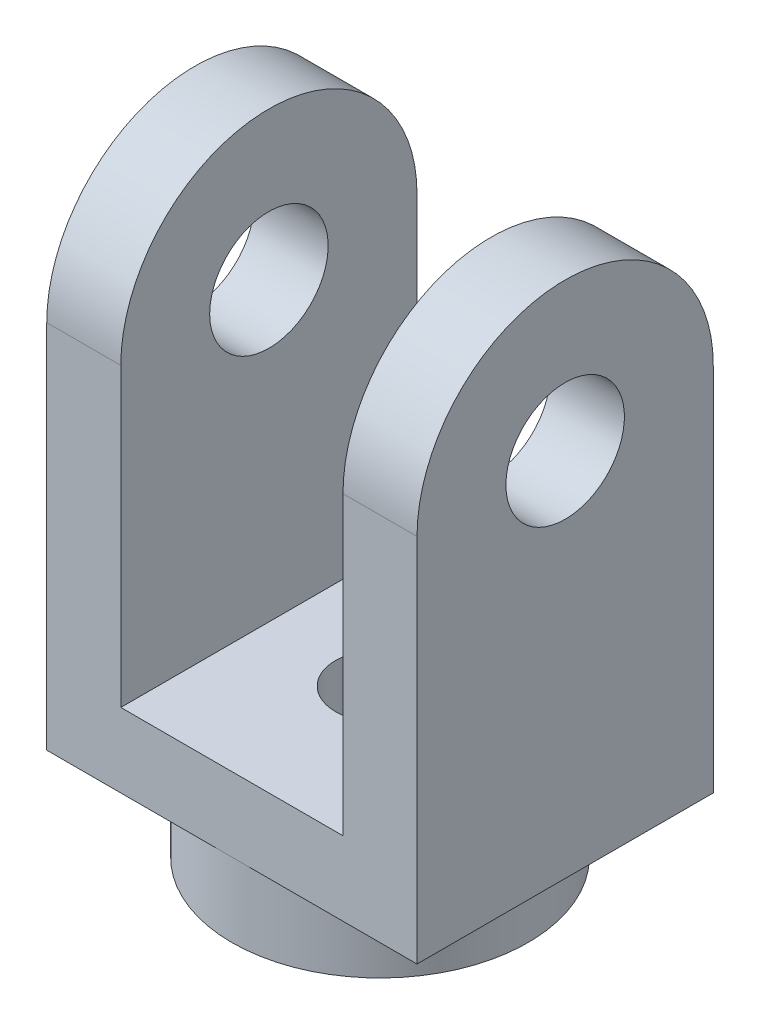
ISO-10303-21;
HEADER;
FILE_DESCRIPTION(('STEP AP214'),'2;1');
FILE_NAME('part.step','',(''),(''),'','','');
FILE_SCHEMA(('AUTOMOTIVE_DESIGN { 1 0 10303 214 1 1 1 1 }'));
ENDSEC;
DATA;
#1=APPLICATION_CONTEXT('core data for automotive mechanical design processes');
#2=APPLICATION_PROTOCOL_DEFINITION('international standard','automotive_design',2000,#1);
#3=PRODUCT_CONTEXT('',#1,'mechanical');
#4=PRODUCT('Part','Part','',(#3));
#5=PRODUCT_RELATED_PRODUCT_CATEGORY('part','',(#4));
#6=PRODUCT_DEFINITION_FORMATION('','',#4);
#7=PRODUCT_DEFINITION_CONTEXT('part definition',#1,'design');
#8=PRODUCT_DEFINITION('design','',#6,#7);
#9=PRODUCT_DEFINITION_SHAPE('','',#8);
#10=(LENGTH_UNIT() NAMED_UNIT(*) SI_UNIT(.MILLI.,.METRE.));
#11=(NAMED_UNIT(*) PLANE_ANGLE_UNIT() SI_UNIT($,.RADIAN.));
#12=(NAMED_UNIT(*) SI_UNIT($,.STERADIAN.) SOLID_ANGLE_UNIT());
#13=UNCERTAINTY_MEASURE_WITH_UNIT(LENGTH_MEASURE(1.E-05),#10,'distance_accuracy_value','');
#14=(GEOMETRIC_REPRESENTATION_CONTEXT(3) GLOBAL_UNCERTAINTY_ASSIGNED_CONTEXT((#13)) GLOBAL_UNIT_ASSIGNED_CONTEXT((#10,
#11,#12)) REPRESENTATION_CONTEXT('',''));
#15=CARTESIAN_POINT('',(0.,0.,0.));
#16=DIRECTION('',(0.,0.,1.));
#17=DIRECTION('',(1.,0.,0.));
#18=AXIS2_PLACEMENT_3D('',#15,#16,#17);
#19=CARTESIAN_POINT('',(0.,50.,0.));
#20=DIRECTION('',(0.,-1.,0.));
#21=DIRECTION('',(0.,0.,-1.));
#22=AXIS2_PLACEMENT_3D('',#19,#20,#21);
#23=PLANE('',#22);
#24=CARTESIAN_POINT('',(0.,50.,0.));
#25=DIRECTION('',(0.,-1.,0.));
#26=DIRECTION('',(0.,0.,-1.));
#27=AXIS2_PLACEMENT_3D('',#24,#25,#26);
#28=CIRCLE('',#27,15.);
#29=CARTESIAN_POINT('',(0.,50.,-15.));
#30=VERTEX_POINT('',#29);
#31=EDGE_CURVE('E181',#30,#30,#28,.T.);
#32=ORIENTED_EDGE('',*,*,#31,.T.);
#33=EDGE_LOOP('',(#32));
#34=FACE_BOUND('',#33,.T.);
#35=DIRECTION('',(0.,0.,1.));
#36=VECTOR('',#35,1.);
#37=CARTESIAN_POINT('',(37.5,50.,-50.));
#38=LINE('',#37,#36);
#39=CARTESIAN_POINT('',(37.5,50.,-50.));
#40=VERTEX_POINT('',#39);
#41=CARTESIAN_POINT('',(37.5,50.,50.));
#42=VERTEX_POINT('',#41);
#43=EDGE_CURVE('E185',#40,#42,#38,.T.);
#44=ORIENTED_EDGE('',*,*,#43,.F.);
#45=DIRECTION('',(1.,0.,0.));
#46=VECTOR('',#45,1.);
#47=CARTESIAN_POINT('',(-62.5,50.,-50.));
#48=LINE('',#47,#46);
#49=CARTESIAN_POINT('',(-37.5,50.,-50.));
#50=VERTEX_POINT('',#49);
#51=EDGE_CURVE('E153',#50,#40,#48,.T.);
#52=ORIENTED_EDGE('',*,*,#51,.F.);
#53=DIRECTION('',(0.,0.,-1.));
#54=VECTOR('',#53,1.);
#55=CARTESIAN_POINT('',(-37.5,50.,-50.));
#56=LINE('',#55,#54);
#57=CARTESIAN_POINT('',(-37.5,50.,50.));
#58=VERTEX_POINT('',#57);
#59=EDGE_CURVE('E75',#58,#50,#56,.T.);
#60=ORIENTED_EDGE('',*,*,#59,.F.);
#61=DIRECTION('',(1.,0.,0.));
#62=VECTOR('',#61,1.);
#63=CARTESIAN_POINT('',(-62.5,50.,50.));
#64=LINE('',#63,#62);
#65=EDGE_CURVE('E214',#58,#42,#64,.T.);
#66=ORIENTED_EDGE('',*,*,#65,.T.);
#67=EDGE_LOOP('',(#44,#52,#60,#66));
#68=FACE_BOUND('',#67,.T.);
#69=ADVANCED_FACE('F57',(#34,#68),#23,.F.);
#70=CARTESIAN_POINT('',(0.,0.,0.));
#71=DIRECTION('',(0.,1.,0.));
#72=DIRECTION('',(0.,0.,1.));
#73=AXIS2_PLACEMENT_3D('',#70,#71,#72);
#74=PLANE('',#73);
#75=CARTESIAN_POINT('',(0.,0.,0.));
#76=DIRECTION('',(0.,1.,0.));
#77=DIRECTION('',(0.,0.,1.));
#78=AXIS2_PLACEMENT_3D('',#75,#76,#77);
#79=CIRCLE('',#78,15.);
#80=CARTESIAN_POINT('',(0.,0.,15.));
#81=VERTEX_POINT('',#80);
#82=EDGE_CURVE('E174',#81,#81,#79,.T.);
#83=ORIENTED_EDGE('',*,*,#82,.T.);
#84=EDGE_LOOP('',(#83));
#85=FACE_BOUND('',#84,.T.);
#86=CARTESIAN_POINT('',(0.,0.,0.));
#87=DIRECTION('',(0.,1.,0.));
#88=DIRECTION('',(0.,0.,1.));
#89=AXIS2_PLACEMENT_3D('',#86,#87,#88);
#90=CIRCLE('',#89,50.);
#91=CARTESIAN_POINT('',(0.,0.,50.));
#92=VERTEX_POINT('',#91);
#93=EDGE_CURVE('E243',#92,#92,#90,.T.);
#94=ORIENTED_EDGE('',*,*,#93,.F.);
#95=EDGE_LOOP('',(#94));
#96=FACE_BOUND('',#95,.T.);
#97=ADVANCED_FACE('F288',(#85,#96),#74,.F.);
#98=CARTESIAN_POINT('',(0.,25.,0.));
#99=DIRECTION('',(0.,-1.,0.));
#100=DIRECTION('',(0.,0.,-1.));
#101=AXIS2_PLACEMENT_3D('',#98,#99,#100);
#102=CYLINDRICAL_SURFACE('',#101,50.);
#103=CARTESIAN_POINT('',(0.,25.,0.));
#104=DIRECTION('',(0.,1.,0.));
#105=DIRECTION('',(0.,0.,1.));
#106=AXIS2_PLACEMENT_3D('',#103,#104,#105);
#107=CIRCLE('',#106,50.);
#108=CARTESIAN_POINT('',(0.,25.,50.));
#109=VERTEX_POINT('',#108);
#110=CARTESIAN_POINT('',(0.,25.,-50.));
#111=VERTEX_POINT('',#110);
#112=EDGE_CURVE('E14',#109,#111,#107,.T.);
#113=ORIENTED_EDGE('',*,*,#112,.F.);
#114=EDGE_CURVE('E67',#111,#109,#107,.T.);
#115=ORIENTED_EDGE('',*,*,#114,.F.);
#116=EDGE_LOOP('',(#113,#115));
#117=FACE_BOUND('',#116,.T.);
#118=ORIENTED_EDGE('',*,*,#93,.T.);
#119=EDGE_LOOP('',(#118));
#120=FACE_BOUND('',#119,.T.);
#121=ADVANCED_FACE('F59',(#117,#120),#102,.T.);
#122=CARTESIAN_POINT('',(0.,25.,0.));
#123=DIRECTION('',(0.,-1.,0.));
#124=DIRECTION('',(0.,0.,-1.));
#125=AXIS2_PLACEMENT_3D('',#122,#123,#124);
#126=PLANE('',#125);
#127=DIRECTION('',(1.,0.,0.));
#128=VECTOR('',#127,1.);
#129=CARTESIAN_POINT('',(-62.5,25.,-50.));
#130=LINE('',#129,#128);
#131=CARTESIAN_POINT('',(62.5,25.,-50.));
#132=VERTEX_POINT('',#131);
#133=EDGE_CURVE('E227',#111,#132,#130,.T.);
#134=ORIENTED_EDGE('',*,*,#133,.T.);
#135=DIRECTION('',(0.,0.,1.));
#136=VECTOR('',#135,1.);
#137=CARTESIAN_POINT('',(62.5,25.,-50.));
#138=LINE('',#137,#136);
#139=CARTESIAN_POINT('',(62.5,25.,50.));
#140=VERTEX_POINT('',#139);
#141=EDGE_CURVE('E223',#132,#140,#138,.T.);
#142=ORIENTED_EDGE('',*,*,#141,.T.);
#143=DIRECTION('',(1.,0.,0.));
#144=VECTOR('',#143,1.);
#145=CARTESIAN_POINT('',(-62.5,25.,50.));
#146=LINE('',#145,#144);
#147=EDGE_CURVE('E213',#109,#140,#146,.T.);
#148=ORIENTED_EDGE('',*,*,#147,.F.);
#149=ORIENTED_EDGE('',*,*,#112,.T.);
#150=EDGE_LOOP('',(#134,#142,#148,#149));
#151=FACE_BOUND('',#150,.T.);
#152=ADVANCED_FACE('F255',(#151),#126,.T.);
#153=CARTESIAN_POINT('',(-62.5,50.,50.));
#154=DIRECTION('',(0.,0.,-1.));
#155=DIRECTION('',(-1.,0.,0.));
#156=AXIS2_PLACEMENT_3D('',#153,#154,#155);
#157=PLANE('',#156);
#158=ORIENTED_EDGE('',*,*,#147,.T.);
#159=DIRECTION('',(0.,-1.,0.));
#160=VECTOR('',#159,1.);
#161=CARTESIAN_POINT('',(62.5,50.,50.));
#162=LINE('',#161,#160);
#163=CARTESIAN_POINT('',(62.5,150.,50.));
#164=VERTEX_POINT('',#163);
#165=EDGE_CURVE('E240',#164,#140,#162,.T.);
#166=ORIENTED_EDGE('',*,*,#165,.F.);
#167=DIRECTION('',(1.,0.,0.));
#168=VECTOR('',#167,1.);
#169=CARTESIAN_POINT('',(62.5,150.,50.));
#170=LINE('',#169,#168);
#171=CARTESIAN_POINT('',(37.5,150.,50.));
#172=VERTEX_POINT('',#171);
#173=EDGE_CURVE('E190',#172,#164,#170,.T.);
#174=ORIENTED_EDGE('',*,*,#173,.F.);
#175=DIRECTION('',(0.,-1.,0.));
#176=VECTOR('',#175,1.);
#177=CARTESIAN_POINT('',(37.5,150.,50.));
#178=LINE('',#177,#176);
#179=EDGE_CURVE('E194',#172,#42,#178,.T.);
#180=ORIENTED_EDGE('',*,*,#179,.T.);
#181=ORIENTED_EDGE('',*,*,#65,.F.);
#182=DIRECTION('',(0.,-1.,0.));
#183=VECTOR('',#182,1.);
#184=CARTESIAN_POINT('',(-37.5,150.,50.));
#185=LINE('',#184,#183);
#186=CARTESIAN_POINT('',(-37.5,150.,50.));
#187=VERTEX_POINT('',#186);
#188=EDGE_CURVE('E137',#187,#58,#185,.T.);
#189=ORIENTED_EDGE('',*,*,#188,.F.);
#190=DIRECTION('',(1.,0.,0.));
#191=VECTOR('',#190,1.);
#192=CARTESIAN_POINT('',(-62.5,150.,50.));
#193=LINE('',#192,#191);
#194=CARTESIAN_POINT('',(-62.5,150.,50.));
#195=VERTEX_POINT('',#194);
#196=EDGE_CURVE('E130',#195,#187,#193,.T.);
#197=ORIENTED_EDGE('',*,*,#196,.F.);
#198=DIRECTION('',(0.,-1.,0.));
#199=VECTOR('',#198,1.);
#200=CARTESIAN_POINT('',(-62.5,50.,50.));
#201=LINE('',#200,#199);
#202=CARTESIAN_POINT('',(-62.5,25.,50.));
#203=VERTEX_POINT('',#202);
#204=EDGE_CURVE('E134',#195,#203,#201,.T.);
#205=ORIENTED_EDGE('',*,*,#204,.T.);
#206=EDGE_CURVE('E220',#203,#109,#146,.T.);
#207=ORIENTED_EDGE('',*,*,#206,.T.);
#208=EDGE_LOOP('',(#158,#166,#174,#180,#181,#189,#197,#205,#207));
#209=FACE_BOUND('',#208,.T.);
#210=ADVANCED_FACE('F132',(#209),#157,.F.);
#211=CARTESIAN_POINT('',(62.5,50.,-50.));
#212=DIRECTION('',(1.,0.,0.));
#213=DIRECTION('',(0.,0.,-1.));
#214=AXIS2_PLACEMENT_3D('',#211,#212,#213);
#215=PLANE('',#214);
#216=CARTESIAN_POINT('',(62.5,150.,0.));
#217=DIRECTION('',(-1.,0.,0.));
#218=DIRECTION('',(0.,0.,1.));
#219=AXIS2_PLACEMENT_3D('',#216,#217,#218);
#220=CIRCLE('',#219,20.);
#221=CARTESIAN_POINT('',(62.5,150.,20.));
#222=VERTEX_POINT('',#221);
#223=EDGE_CURVE('E448',#222,#222,#220,.T.);
#224=ORIENTED_EDGE('',*,*,#223,.T.);
#225=EDGE_LOOP('',(#224));
#226=FACE_BOUND('',#225,.T.);
#227=ORIENTED_EDGE('',*,*,#141,.F.);
#228=DIRECTION('',(0.,-1.,0.));
#229=VECTOR('',#228,1.);
#230=CARTESIAN_POINT('',(62.5,50.,-50.));
#231=LINE('',#230,#229);
#232=CARTESIAN_POINT('',(62.5,150.,-50.));
#233=VERTEX_POINT('',#232);
#234=EDGE_CURVE('E236',#233,#132,#231,.T.);
#235=ORIENTED_EDGE('',*,*,#234,.F.);
#236=CARTESIAN_POINT('',(62.5,150.,0.));
#237=DIRECTION('',(1.,0.,0.));
#238=DIRECTION('',(0.,0.,1.));
#239=AXIS2_PLACEMENT_3D('',#236,#237,#238);
#240=CIRCLE('',#239,50.);
#241=EDGE_CURVE('E164',#233,#164,#240,.T.);
#242=ORIENTED_EDGE('',*,*,#241,.T.);
#243=ORIENTED_EDGE('',*,*,#165,.T.);
#244=EDGE_LOOP('',(#227,#235,#242,#243));
#245=FACE_BOUND('',#244,.T.);
#246=ADVANCED_FACE('F264',(#226,#245),#215,.T.);
#247=CARTESIAN_POINT('',(-62.5,50.,-50.));
#248=DIRECTION('',(0.,0.,-1.));
#249=DIRECTION('',(-1.,0.,0.));
#250=AXIS2_PLACEMENT_3D('',#247,#248,#249);
#251=PLANE('',#250);
#252=ORIENTED_EDGE('',*,*,#51,.T.);
#253=DIRECTION('',(0.,-1.,0.));
#254=VECTOR('',#253,1.);
#255=CARTESIAN_POINT('',(37.5,150.,-50.));
#256=LINE('',#255,#254);
#257=CARTESIAN_POINT('',(37.5,150.,-50.));
#258=VERTEX_POINT('',#257);
#259=EDGE_CURVE('E200',#258,#40,#256,.T.);
#260=ORIENTED_EDGE('',*,*,#259,.F.);
#261=DIRECTION('',(-1.,0.,0.));
#262=VECTOR('',#261,1.);
#263=CARTESIAN_POINT('',(62.5,150.,-50.));
#264=LINE('',#263,#262);
#265=EDGE_CURVE('E186',#233,#258,#264,.T.);
#266=ORIENTED_EDGE('',*,*,#265,.F.);
#267=ORIENTED_EDGE('',*,*,#234,.T.);
#268=ORIENTED_EDGE('',*,*,#133,.F.);
#269=CARTESIAN_POINT('',(-62.5,25.,-50.));
#270=VERTEX_POINT('',#269);
#271=EDGE_CURVE('E228',#270,#111,#130,.T.);
#272=ORIENTED_EDGE('',*,*,#271,.F.);
#273=DIRECTION('',(0.,-1.,0.));
#274=VECTOR('',#273,1.);
#275=CARTESIAN_POINT('',(-62.5,50.,-50.));
#276=LINE('',#275,#274);
#277=CARTESIAN_POINT('',(-62.5,150.,-50.));
#278=VERTEX_POINT('',#277);
#279=EDGE_CURVE('E152',#278,#270,#276,.T.);
#280=ORIENTED_EDGE('',*,*,#279,.F.);
#281=DIRECTION('',(-1.,0.,0.));
#282=VECTOR('',#281,1.);
#283=CARTESIAN_POINT('',(-62.5,150.,-50.));
#284=LINE('',#283,#282);
#285=CARTESIAN_POINT('',(-37.5,150.,-50.));
#286=VERTEX_POINT('',#285);
#287=EDGE_CURVE('E143',#286,#278,#284,.T.);
#288=ORIENTED_EDGE('',*,*,#287,.F.);
#289=DIRECTION('',(0.,-1.,0.));
#290=VECTOR('',#289,1.);
#291=CARTESIAN_POINT('',(-37.5,150.,-50.));
#292=LINE('',#291,#290);
#293=EDGE_CURVE('E205',#286,#50,#292,.T.);
#294=ORIENTED_EDGE('',*,*,#293,.T.);
#295=EDGE_LOOP('',(#252,#260,#266,#267,#268,#272,#280,#288,#294));
#296=FACE_BOUND('',#295,.T.);
#297=ADVANCED_FACE('F261',(#296),#251,.T.);
#298=CARTESIAN_POINT('',(-62.5,50.,-50.));
#299=DIRECTION('',(1.,0.,0.));
#300=DIRECTION('',(0.,0.,-1.));
#301=AXIS2_PLACEMENT_3D('',#298,#299,#300);
#302=PLANE('',#301);
#303=CARTESIAN_POINT('',(-62.5,150.,0.));
#304=DIRECTION('',(1.,0.,0.));
#305=DIRECTION('',(0.,0.,-1.));
#306=AXIS2_PLACEMENT_3D('',#303,#304,#305);
#307=CIRCLE('',#306,20.);
#308=CARTESIAN_POINT('',(-62.5,150.,-20.));
#309=VERTEX_POINT('',#308);
#310=EDGE_CURVE('E160',#309,#309,#307,.T.);
#311=ORIENTED_EDGE('',*,*,#310,.T.);
#312=EDGE_LOOP('',(#311));
#313=FACE_BOUND('',#312,.T.);
#314=DIRECTION('',(0.,0.,1.));
#315=VECTOR('',#314,1.);
#316=CARTESIAN_POINT('',(-62.5,25.,-50.));
#317=LINE('',#316,#315);
#318=EDGE_CURVE('E150',#270,#203,#317,.T.);
#319=ORIENTED_EDGE('',*,*,#318,.T.);
#320=ORIENTED_EDGE('',*,*,#204,.F.);
#321=CARTESIAN_POINT('',(-62.5,150.,0.));
#322=DIRECTION('',(-1.,0.,0.));
#323=DIRECTION('',(0.,0.,-1.));
#324=AXIS2_PLACEMENT_3D('',#321,#322,#323);
#325=CIRCLE('',#324,50.);
#326=EDGE_CURVE('E148',#195,#278,#325,.T.);
#327=ORIENTED_EDGE('',*,*,#326,.T.);
#328=ORIENTED_EDGE('',*,*,#279,.T.);
#329=EDGE_LOOP('',(#319,#320,#327,#328));
#330=FACE_BOUND('',#329,.T.);
#331=ADVANCED_FACE('F147',(#313,#330),#302,.F.);
#332=ORIENTED_EDGE('',*,*,#271,.T.);
#333=ORIENTED_EDGE('',*,*,#114,.T.);
#334=ORIENTED_EDGE('',*,*,#206,.F.);
#335=ORIENTED_EDGE('',*,*,#318,.F.);
#336=EDGE_LOOP('',(#332,#333,#334,#335));
#337=FACE_BOUND('',#336,.T.);
#338=ADVANCED_FACE('F251',(#337),#126,.T.);
#339=CARTESIAN_POINT('',(-37.5,150.,-50.));
#340=DIRECTION('',(-1.,0.,0.));
#341=DIRECTION('',(0.,0.,1.));
#342=AXIS2_PLACEMENT_3D('',#339,#340,#341);
#343=PLANE('',#342);
#344=CARTESIAN_POINT('',(-37.5,150.,0.));
#345=DIRECTION('',(-1.,0.,0.));
#346=DIRECTION('',(0.,0.,1.));
#347=AXIS2_PLACEMENT_3D('',#344,#345,#346);
#348=CIRCLE('',#347,20.);
#349=CARTESIAN_POINT('',(-37.5,150.,20.));
#350=VERTEX_POINT('',#349);
#351=EDGE_CURVE('E167',#350,#350,#348,.T.);
#352=ORIENTED_EDGE('',*,*,#351,.T.);
#353=EDGE_LOOP('',(#352));
#354=FACE_BOUND('',#353,.T.);
#355=ORIENTED_EDGE('',*,*,#59,.T.);
#356=ORIENTED_EDGE('',*,*,#293,.F.);
#357=CARTESIAN_POINT('',(-37.5,150.,0.));
#358=DIRECTION('',(-1.,0.,0.));
#359=DIRECTION('',(0.,0.,-1.));
#360=AXIS2_PLACEMENT_3D('',#357,#358,#359);
#361=CIRCLE('',#360,50.);
#362=EDGE_CURVE('E159',#187,#286,#361,.T.);
#363=ORIENTED_EDGE('',*,*,#362,.F.);
#364=ORIENTED_EDGE('',*,*,#188,.T.);
#365=EDGE_LOOP('',(#355,#356,#363,#364));
#366=FACE_BOUND('',#365,.T.);
#367=ADVANCED_FACE('F273',(#354,#366),#343,.F.);
#368=CARTESIAN_POINT('',(37.5,150.,-50.));
#369=DIRECTION('',(1.,0.,0.));
#370=DIRECTION('',(0.,0.,-1.));
#371=AXIS2_PLACEMENT_3D('',#368,#369,#370);
#372=PLANE('',#371);
#373=CARTESIAN_POINT('',(37.5,150.,0.));
#374=DIRECTION('',(1.,0.,0.));
#375=DIRECTION('',(0.,0.,-1.));
#376=AXIS2_PLACEMENT_3D('',#373,#374,#375);
#377=CIRCLE('',#376,20.);
#378=CARTESIAN_POINT('',(37.5,150.,-20.));
#379=VERTEX_POINT('',#378);
#380=EDGE_CURVE('E61',#379,#379,#377,.T.);
#381=ORIENTED_EDGE('',*,*,#380,.T.);
#382=EDGE_LOOP('',(#381));
#383=FACE_BOUND('',#382,.T.);
#384=ORIENTED_EDGE('',*,*,#43,.T.);
#385=ORIENTED_EDGE('',*,*,#179,.F.);
#386=CARTESIAN_POINT('',(37.5,150.,0.));
#387=DIRECTION('',(1.,0.,0.));
#388=DIRECTION('',(0.,0.,1.));
#389=AXIS2_PLACEMENT_3D('',#386,#387,#388);
#390=CIRCLE('',#389,50.);
#391=EDGE_CURVE('E170',#258,#172,#390,.T.);
#392=ORIENTED_EDGE('',*,*,#391,.F.);
#393=ORIENTED_EDGE('',*,*,#259,.T.);
#394=EDGE_LOOP('',(#384,#385,#392,#393));
#395=FACE_BOUND('',#394,.T.);
#396=ADVANCED_FACE('F270',(#383,#395),#372,.F.);
#397=CARTESIAN_POINT('',(0.,0.,0.));
#398=DIRECTION('',(0.,1.,0.));
#399=DIRECTION('',(0.,0.,1.));
#400=AXIS2_PLACEMENT_3D('',#397,#398,#399);
#401=CYLINDRICAL_SURFACE('',#400,15.);
#402=ORIENTED_EDGE('',*,*,#82,.F.);
#403=EDGE_LOOP('',(#402));
#404=FACE_BOUND('',#403,.T.);
#405=ORIENTED_EDGE('',*,*,#31,.F.);
#406=EDGE_LOOP('',(#405));
#407=FACE_BOUND('',#406,.T.);
#408=ADVANCED_FACE('F281',(#404,#407),#401,.F.);
#409=CARTESIAN_POINT('',(37.5,150.,0.));
#410=DIRECTION('',(1.,0.,0.));
#411=DIRECTION('',(0.,0.,-1.));
#412=AXIS2_PLACEMENT_3D('',#409,#410,#411);
#413=CYLINDRICAL_SURFACE('',#412,50.);
#414=ORIENTED_EDGE('',*,*,#241,.F.);
#415=ORIENTED_EDGE('',*,*,#265,.T.);
#416=ORIENTED_EDGE('',*,*,#391,.T.);
#417=ORIENTED_EDGE('',*,*,#173,.T.);
#418=EDGE_LOOP('',(#414,#415,#416,#417));
#419=FACE_BOUND('',#418,.T.);
#420=ADVANCED_FACE('F267',(#419),#413,.T.);
#421=CARTESIAN_POINT('',(-37.5,150.,0.));
#422=DIRECTION('',(-1.,0.,0.));
#423=DIRECTION('',(0.,0.,1.));
#424=AXIS2_PLACEMENT_3D('',#421,#422,#423);
#425=CYLINDRICAL_SURFACE('',#424,50.);
#426=ORIENTED_EDGE('',*,*,#326,.F.);
#427=ORIENTED_EDGE('',*,*,#196,.T.);
#428=ORIENTED_EDGE('',*,*,#362,.T.);
#429=ORIENTED_EDGE('',*,*,#287,.T.);
#430=EDGE_LOOP('',(#426,#427,#428,#429));
#431=FACE_BOUND('',#430,.T.);
#432=ADVANCED_FACE('F156',(#431),#425,.T.);
#433=CARTESIAN_POINT('',(62.5,150.,0.));
#434=DIRECTION('',(-1.,0.,0.));
#435=DIRECTION('',(0.,0.,1.));
#436=AXIS2_PLACEMENT_3D('',#433,#434,#435);
#437=CYLINDRICAL_SURFACE('',#436,20.);
#438=ORIENTED_EDGE('',*,*,#223,.F.);
#439=EDGE_LOOP('',(#438));
#440=FACE_BOUND('',#439,.T.);
#441=ORIENTED_EDGE('',*,*,#380,.F.);
#442=EDGE_LOOP('',(#441));
#443=FACE_BOUND('',#442,.T.);
#444=ADVANCED_FACE('F348',(#440,#443),#437,.F.);
#445=ORIENTED_EDGE('',*,*,#351,.F.);
#446=EDGE_LOOP('',(#445));
#447=FACE_BOUND('',#446,.T.);
#448=ORIENTED_EDGE('',*,*,#310,.F.);
#449=EDGE_LOOP('',(#448));
#450=FACE_BOUND('',#449,.T.);
#451=ADVANCED_FACE('F357',(#447,#450),#437,.F.);
#452=CLOSED_SHELL('',(#69,#97,#121,#152,#210,#246,#297,#331,#338,#367,#396,#408,#420,#432,#444,#451));
#453=MANIFOLD_SOLID_BREP('B2',#452);
#454=ADVANCED_BREP_SHAPE_REPRESENTATION('',(#18,#453),#14);
#455=SHAPE_DEFINITION_REPRESENTATION(#9,#454);
ENDSEC;
END-ISO-10303-21;
